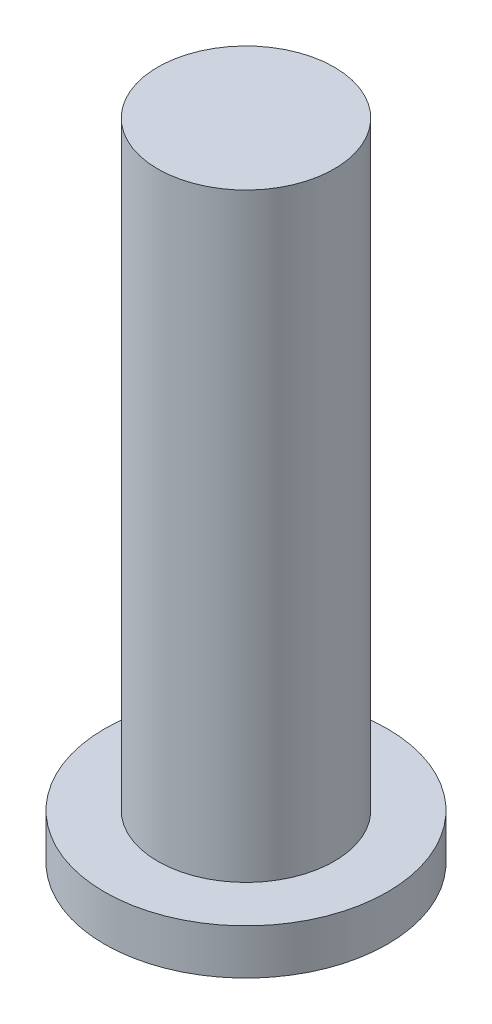
ISO-10303-21;
HEADER;
FILE_DESCRIPTION(('STEP AP214'),'2;1');
FILE_NAME('part.step','',(''),(''),'','','');
FILE_SCHEMA(('AUTOMOTIVE_DESIGN { 1 0 10303 214 1 1 1 1 }'));
ENDSEC;
DATA;
#1=APPLICATION_CONTEXT('core data for automotive mechanical design processes');
#2=APPLICATION_PROTOCOL_DEFINITION('international standard','automotive_design',2000,#1);
#3=PRODUCT_CONTEXT('',#1,'mechanical');
#4=PRODUCT('Part','Part','',(#3));
#5=PRODUCT_RELATED_PRODUCT_CATEGORY('part','',(#4));
#6=PRODUCT_DEFINITION_FORMATION('','',#4);
#7=PRODUCT_DEFINITION_CONTEXT('part definition',#1,'design');
#8=PRODUCT_DEFINITION('design','',#6,#7);
#9=PRODUCT_DEFINITION_SHAPE('','',#8);
#10=(LENGTH_UNIT() NAMED_UNIT(*) SI_UNIT(.MILLI.,.METRE.));
#11=(NAMED_UNIT(*) PLANE_ANGLE_UNIT() SI_UNIT($,.RADIAN.));
#12=(NAMED_UNIT(*) SI_UNIT($,.STERADIAN.) SOLID_ANGLE_UNIT());
#13=UNCERTAINTY_MEASURE_WITH_UNIT(LENGTH_MEASURE(1.E-05),#10,'distance_accuracy_value','');
#14=(GEOMETRIC_REPRESENTATION_CONTEXT(3) GLOBAL_UNCERTAINTY_ASSIGNED_CONTEXT((#13)) GLOBAL_UNIT_ASSIGNED_CONTEXT((#10,
#11,#12)) REPRESENTATION_CONTEXT('',''));
#15=CARTESIAN_POINT('',(0.,0.,0.));
#16=DIRECTION('',(0.,0.,1.));
#17=DIRECTION('',(1.,0.,0.));
#18=AXIS2_PLACEMENT_3D('',#15,#16,#17);
#19=CARTESIAN_POINT('',(0.,33.655,0.));
#20=DIRECTION('',(0.,-1.,0.));
#21=DIRECTION('',(0.,0.,-1.));
#22=AXIS2_PLACEMENT_3D('',#19,#20,#21);
#23=CYLINDRICAL_SURFACE('',#22,4.953);
#24=CARTESIAN_POINT('',(0.,33.655,0.));
#25=DIRECTION('',(0.,1.,0.));
#26=DIRECTION('',(0.,0.,1.));
#27=AXIS2_PLACEMENT_3D('',#24,#25,#26);
#28=CIRCLE('',#27,4.953);
#29=CARTESIAN_POINT('',(0.,33.655,4.953));
#30=VERTEX_POINT('',#29);
#31=EDGE_CURVE('E10',#30,#30,#28,.T.);
#32=ORIENTED_EDGE('',*,*,#31,.F.);
#33=EDGE_LOOP('',(#32));
#34=FACE_BOUND('',#33,.T.);
#35=CARTESIAN_POINT('',(0.,0.,0.));
#36=DIRECTION('',(0.,1.,0.));
#37=DIRECTION('',(0.,0.,1.));
#38=AXIS2_PLACEMENT_3D('',#35,#36,#37);
#39=CIRCLE('',#38,4.953);
#40=CARTESIAN_POINT('',(0.,0.,4.953));
#41=VERTEX_POINT('',#40);
#42=EDGE_CURVE('E40',#41,#41,#39,.T.);
#43=ORIENTED_EDGE('',*,*,#42,.T.);
#44=EDGE_LOOP('',(#43));
#45=FACE_BOUND('',#44,.T.);
#46=ADVANCED_FACE('F37',(#34,#45),#23,.T.);
#47=CARTESIAN_POINT('',(0.,33.655,0.));
#48=DIRECTION('',(0.,1.,0.));
#49=DIRECTION('',(0.,0.,1.));
#50=AXIS2_PLACEMENT_3D('',#47,#48,#49);
#51=PLANE('',#50);
#52=ORIENTED_EDGE('',*,*,#31,.T.);
#53=EDGE_LOOP('',(#52));
#54=FACE_BOUND('',#53,.T.);
#55=ADVANCED_FACE('F68',(#54),#51,.T.);
#56=CARTESIAN_POINT('',(0.,-2.54,0.));
#57=DIRECTION('',(0.,1.,0.));
#58=DIRECTION('',(0.,0.,1.));
#59=AXIS2_PLACEMENT_3D('',#56,#57,#58);
#60=CYLINDRICAL_SURFACE('',#59,7.9375);
#61=CARTESIAN_POINT('',(0.,-2.54,0.));
#62=DIRECTION('',(0.,1.,0.));
#63=DIRECTION('',(0.,0.,1.));
#64=AXIS2_PLACEMENT_3D('',#61,#62,#63);
#65=CIRCLE('',#64,7.9375);
#66=CARTESIAN_POINT('',(0.,-2.54,7.9375));
#67=VERTEX_POINT('',#66);
#68=EDGE_CURVE('E47',#67,#67,#65,.T.);
#69=ORIENTED_EDGE('',*,*,#68,.T.);
#70=EDGE_LOOP('',(#69));
#71=FACE_BOUND('',#70,.T.);
#72=CARTESIAN_POINT('',(0.,0.,0.));
#73=DIRECTION('',(0.,1.,0.));
#74=DIRECTION('',(0.,0.,1.));
#75=AXIS2_PLACEMENT_3D('',#72,#73,#74);
#76=CIRCLE('',#75,7.9375);
#77=CARTESIAN_POINT('',(0.,0.,7.9375));
#78=VERTEX_POINT('',#77);
#79=EDGE_CURVE('E49',#78,#78,#76,.T.);
#80=ORIENTED_EDGE('',*,*,#79,.F.);
#81=EDGE_LOOP('',(#80));
#82=FACE_BOUND('',#81,.T.);
#83=ADVANCED_FACE('F55',(#71,#82),#60,.T.);
#84=CARTESIAN_POINT('',(0.,-2.54,0.));
#85=DIRECTION('',(0.,1.,0.));
#86=DIRECTION('',(0.,0.,1.));
#87=AXIS2_PLACEMENT_3D('',#84,#85,#86);
#88=PLANE('',#87);
#89=ORIENTED_EDGE('',*,*,#68,.F.);
#90=EDGE_LOOP('',(#89));
#91=FACE_BOUND('',#90,.T.);
#92=ADVANCED_FACE('F58',(#91),#88,.F.);
#93=CARTESIAN_POINT('',(0.,0.,0.));
#94=DIRECTION('',(0.,1.,0.));
#95=DIRECTION('',(0.,0.,1.));
#96=AXIS2_PLACEMENT_3D('',#93,#94,#95);
#97=PLANE('',#96);
#98=ORIENTED_EDGE('',*,*,#42,.F.);
#99=EDGE_LOOP('',(#98));
#100=FACE_BOUND('',#99,.T.);
#101=ORIENTED_EDGE('',*,*,#79,.T.);
#102=EDGE_LOOP('',(#101));
#103=FACE_BOUND('',#102,.T.);
#104=ADVANCED_FACE('F60',(#100,#103),#97,.T.);
#105=CLOSED_SHELL('',(#46,#55,#83,#92,#104));
#106=MANIFOLD_SOLID_BREP('B2',#105);
#107=ADVANCED_BREP_SHAPE_REPRESENTATION('',(#18,#106),#14);
#108=SHAPE_DEFINITION_REPRESENTATION(#9,#107);
ENDSEC;
END-ISO-10303-21;
